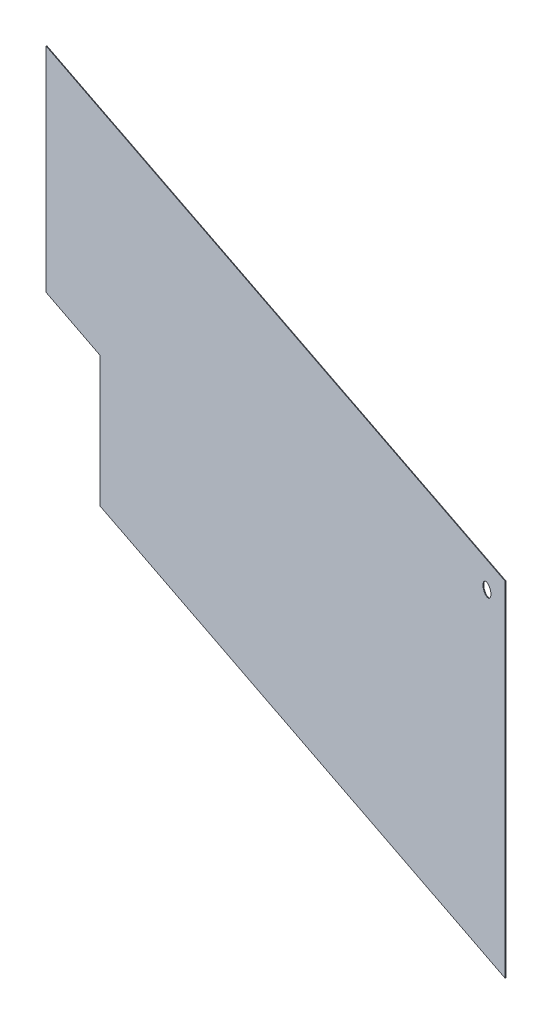
ISO-10303-21;
HEADER;
FILE_DESCRIPTION(('STEP AP214'),'2;1');
FILE_NAME('part.step','',(''),(''),'','','');
FILE_SCHEMA(('AUTOMOTIVE_DESIGN { 1 0 10303 214 1 1 1 1 }'));
ENDSEC;
DATA;
#1=APPLICATION_CONTEXT('core data for automotive mechanical design processes');
#2=APPLICATION_PROTOCOL_DEFINITION('international standard','automotive_design',2000,#1);
#3=PRODUCT_CONTEXT('',#1,'mechanical');
#4=PRODUCT('Part','Part','',(#3));
#5=PRODUCT_RELATED_PRODUCT_CATEGORY('part','',(#4));
#6=PRODUCT_DEFINITION_FORMATION('','',#4);
#7=PRODUCT_DEFINITION_CONTEXT('part definition',#1,'design');
#8=PRODUCT_DEFINITION('design','',#6,#7);
#9=PRODUCT_DEFINITION_SHAPE('','',#8);
#10=(LENGTH_UNIT() NAMED_UNIT(*) SI_UNIT(.MILLI.,.METRE.));
#11=(NAMED_UNIT(*) PLANE_ANGLE_UNIT() SI_UNIT($,.RADIAN.));
#12=(NAMED_UNIT(*) SI_UNIT($,.STERADIAN.) SOLID_ANGLE_UNIT());
#13=UNCERTAINTY_MEASURE_WITH_UNIT(LENGTH_MEASURE(1.E-05),#10,'distance_accuracy_value','');
#14=(GEOMETRIC_REPRESENTATION_CONTEXT(3) GLOBAL_UNCERTAINTY_ASSIGNED_CONTEXT((#13)) GLOBAL_UNIT_ASSIGNED_CONTEXT((#10,
#11,#12)) REPRESENTATION_CONTEXT('',''));
#15=CARTESIAN_POINT('',(0.,0.,0.));
#16=DIRECTION('',(0.,0.,1.));
#17=DIRECTION('',(1.,0.,0.));
#18=AXIS2_PLACEMENT_3D('',#15,#16,#17);
#19=CARTESIAN_POINT('',(-263.180218446603,546.5,779.785337524628));
#20=DIRECTION('',(-0.947491297113765,0.,-0.319781553398059));
#21=DIRECTION('',(0.,1.,0.));
#22=AXIS2_PLACEMENT_3D('',#19,#20,#21);
#23=PLANE('',#22);
#24=DIRECTION('',(0.319781553398059,0.,-0.947491297113765));
#25=VECTOR('',#24,1.);
#26=CARTESIAN_POINT('',(-263.180218446603,1093.,779.785337524628));
#27=LINE('',#26,#25);
#28=CARTESIAN_POINT('',(-263.500000000001,1093.,780.732828821742));
#29=VERTEX_POINT('',#28);
#30=CARTESIAN_POINT('',(-262.860436893205,1093.,778.837846227515));
#31=VERTEX_POINT('',#30);
#32=EDGE_CURVE('E11',#29,#31,#27,.T.);
#33=ORIENTED_EDGE('',*,*,#32,.F.);
#34=DIRECTION('',(0.,1.,0.));
#35=VECTOR('',#34,1.);
#36=CARTESIAN_POINT('',(-263.500000000001,546.5,780.732828821742));
#37=LINE('',#36,#35);
#38=CARTESIAN_POINT('',(-263.500000000001,0.,780.732828821742));
#39=VERTEX_POINT('',#38);
#40=EDGE_CURVE('E118',#29,#39,#37,.F.);
#41=ORIENTED_EDGE('',*,*,#40,.T.);
#42=DIRECTION('',(0.319781553398059,0.,-0.947491297113765));
#43=VECTOR('',#42,1.);
#44=CARTESIAN_POINT('',(-263.180218446603,0.,779.785337524628));
#45=LINE('',#44,#43);
#46=CARTESIAN_POINT('',(-262.860436893205,0.,778.837846227515));
#47=VERTEX_POINT('',#46);
#48=EDGE_CURVE('E51',#39,#47,#45,.T.);
#49=ORIENTED_EDGE('',*,*,#48,.T.);
#50=DIRECTION('',(0.,1.,0.));
#51=VECTOR('',#50,1.);
#52=CARTESIAN_POINT('',(-262.860436893205,546.5,778.837846227515));
#53=LINE('',#52,#51);
#54=EDGE_CURVE('E131',#31,#47,#53,.F.);
#55=ORIENTED_EDGE('',*,*,#54,.F.);
#56=EDGE_LOOP('',(#33,#41,#49,#55));
#57=FACE_BOUND('',#56,.T.);
#58=ADVANCED_FACE('F40',(#57),#23,.F.);
#59=CARTESIAN_POINT('',(-1363.52038558934,0.,408.416767716082));
#60=DIRECTION('',(0.,-1.,0.));
#61=DIRECTION('',(-0.947491297113765,0.,-0.319781553398059));
#62=AXIS2_PLACEMENT_3D('',#59,#60,#61);
#63=PLANE('',#62);
#64=ORIENTED_EDGE('',*,*,#48,.F.);
#65=DIRECTION('',(-0.947491297113765,0.,-0.319781553398059));
#66=VECTOR('',#65,1.);
#67=CARTESIAN_POINT('',(-1363.84016714274,0.,409.364259013195));
#68=LINE('',#67,#66);
#69=CARTESIAN_POINT('',(-2205.62930846116,0.,125.257544719962));
#70=VERTEX_POINT('',#69);
#71=EDGE_CURVE('E111',#39,#70,#68,.T.);
#72=ORIENTED_EDGE('',*,*,#71,.T.);
#73=DIRECTION('',(-0.606307072718308,0.,0.795230616596065));
#74=VECTOR('',#73,1.);
#75=CARTESIAN_POINT('',(-2032.58944425804,-1.11022302462516E-13,-101.701044578701));
#76=LINE('',#75,#74);
#77=CARTESIAN_POINT('',(-2204.34931535845,0.,123.578709439765));
#78=VERTEX_POINT('',#77);
#79=EDGE_CURVE('E96',#70,#78,#76,.F.);
#80=ORIENTED_EDGE('',*,*,#79,.T.);
#81=DIRECTION('',(-0.947491297113765,0.,-0.319781553398059));
#82=VECTOR('',#81,1.);
#83=CARTESIAN_POINT('',(-1363.20060403594,0.,407.469276418968));
#84=LINE('',#83,#82);
#85=EDGE_CURVE('E143',#47,#78,#84,.T.);
#86=ORIENTED_EDGE('',*,*,#85,.F.);
#87=EDGE_LOOP('',(#64,#72,#80,#86));
#88=FACE_BOUND('',#87,.T.);
#89=ADVANCED_FACE('F115',(#88),#63,.T.);
#90=CARTESIAN_POINT('',(-2204.34931535845,0.,123.578709439765));
#91=DIRECTION('',(0.795230616596064,0.,0.606307072718308));
#92=DIRECTION('',(0.606307072718308,0.,-0.795230616596065));
#93=AXIS2_PLACEMENT_3D('',#90,#91,#92);
#94=PLANE('',#93);
#95=ORIENTED_EDGE('',*,*,#79,.F.);
#96=DIRECTION('',(0.,-1.,0.));
#97=VECTOR('',#96,1.);
#98=CARTESIAN_POINT('',(-2205.62930846116,546.500000000001,125.257544719962));
#99=LINE('',#98,#97);
#100=CARTESIAN_POINT('',(-2205.62930846116,415.,125.257544719962));
#101=VERTEX_POINT('',#100);
#102=EDGE_CURVE('E44',#70,#101,#99,.F.);
#103=ORIENTED_EDGE('',*,*,#102,.T.);
#104=DIRECTION('',(-0.606307072718308,0.,0.795230616596065));
#105=VECTOR('',#104,1.);
#106=CARTESIAN_POINT('',(-2032.58944425804,415.,-101.7010445787));
#107=LINE('',#106,#105);
#108=CARTESIAN_POINT('',(-2204.34931535845,415.,123.578709439765));
#109=VERTEX_POINT('',#108);
#110=EDGE_CURVE('E90',#101,#109,#107,.F.);
#111=ORIENTED_EDGE('',*,*,#110,.T.);
#112=DIRECTION('',(0.,-1.,0.));
#113=VECTOR('',#112,1.);
#114=CARTESIAN_POINT('',(-2204.34931535845,546.500000000001,123.578709439765));
#115=LINE('',#114,#113);
#116=EDGE_CURVE('E99',#78,#109,#115,.F.);
#117=ORIENTED_EDGE('',*,*,#116,.F.);
#118=EDGE_LOOP('',(#95,#103,#111,#117));
#119=FACE_BOUND('',#118,.T.);
#120=ADVANCED_FACE('F42',(#119),#94,.F.);
#121=CARTESIAN_POINT('',(-1363.52038558934,415.,408.416767716082));
#122=DIRECTION('',(0.,-1.,0.));
#123=DIRECTION('',(-0.947491297113765,0.,-0.319781553398059));
#124=AXIS2_PLACEMENT_3D('',#121,#122,#123);
#125=PLANE('',#124);
#126=ORIENTED_EDGE('',*,*,#110,.F.);
#127=DIRECTION('',(-0.947491297113765,0.,-0.319781553398059));
#128=VECTOR('',#127,1.);
#129=CARTESIAN_POINT('',(-1363.84016714274,415.,409.364259013195));
#130=LINE('',#129,#128);
#131=CARTESIAN_POINT('',(-2464.18033428547,415.,37.9956892046474));
#132=VERTEX_POINT('',#131);
#133=EDGE_CURVE('E113',#101,#132,#130,.T.);
#134=ORIENTED_EDGE('',*,*,#133,.T.);
#135=DIRECTION('',(0.319781553398059,0.,-0.947491297113765));
#136=VECTOR('',#135,1.);
#137=CARTESIAN_POINT('',(-2463.86055273208,415.,37.0481979075337));
#138=LINE('',#137,#136);
#139=CARTESIAN_POINT('',(-2463.54077117868,415.,36.10070661042));
#140=VERTEX_POINT('',#139);
#141=EDGE_CURVE('E133',#132,#140,#138,.T.);
#142=ORIENTED_EDGE('',*,*,#141,.T.);
#143=DIRECTION('',(-0.947491297113765,0.,-0.319781553398059));
#144=VECTOR('',#143,1.);
#145=CARTESIAN_POINT('',(-1363.20060403594,415.,407.469276418968));
#146=LINE('',#145,#144);
#147=EDGE_CURVE('E142',#109,#140,#146,.T.);
#148=ORIENTED_EDGE('',*,*,#147,.F.);
#149=EDGE_LOOP('',(#126,#134,#142,#148));
#150=FACE_BOUND('',#149,.T.);
#151=ADVANCED_FACE('F151',(#150),#125,.T.);
#152=CARTESIAN_POINT('',(-2463.86055273208,546.5,37.0481979075337));
#153=DIRECTION('',(-0.947491297113765,0.,-0.319781553398059));
#154=DIRECTION('',(0.,1.,0.));
#155=AXIS2_PLACEMENT_3D('',#152,#153,#154);
#156=PLANE('',#155);
#157=ORIENTED_EDGE('',*,*,#141,.F.);
#158=DIRECTION('',(0.,1.,0.));
#159=VECTOR('',#158,1.);
#160=CARTESIAN_POINT('',(-2464.18033428547,546.5,37.9956892046474));
#161=LINE('',#160,#159);
#162=CARTESIAN_POINT('',(-2464.18033428547,1093.,37.9956892046474));
#163=VERTEX_POINT('',#162);
#164=EDGE_CURVE('E132',#132,#163,#161,.T.);
#165=ORIENTED_EDGE('',*,*,#164,.T.);
#166=DIRECTION('',(0.319781553398059,0.,-0.947491297113765));
#167=VECTOR('',#166,1.);
#168=CARTESIAN_POINT('',(-2463.86055273208,1093.,37.0481979075337));
#169=LINE('',#168,#167);
#170=CARTESIAN_POINT('',(-2463.54077117868,1093.,36.10070661042));
#171=VERTEX_POINT('',#170);
#172=EDGE_CURVE('E60',#163,#171,#169,.T.);
#173=ORIENTED_EDGE('',*,*,#172,.T.);
#174=DIRECTION('',(0.,1.,0.));
#175=VECTOR('',#174,1.);
#176=CARTESIAN_POINT('',(-2463.54077117868,546.5,36.10070661042));
#177=LINE('',#176,#175);
#178=EDGE_CURVE('E152',#140,#171,#177,.T.);
#179=ORIENTED_EDGE('',*,*,#178,.F.);
#180=EDGE_LOOP('',(#157,#165,#173,#179));
#181=FACE_BOUND('',#180,.T.);
#182=ADVANCED_FACE('F218',(#181),#156,.T.);
#183=CARTESIAN_POINT('',(-1363.52038558934,1093.,408.416767716081));
#184=DIRECTION('',(0.,-1.,0.));
#185=DIRECTION('',(-0.947491297113765,0.,-0.319781553398059));
#186=AXIS2_PLACEMENT_3D('',#183,#184,#185);
#187=PLANE('',#186);
#188=DIRECTION('',(-0.947491297113765,0.,-0.319781553398059));
#189=VECTOR('',#188,1.);
#190=CARTESIAN_POINT('',(-1363.84016714274,1093.,409.364259013195));
#191=LINE('',#190,#189);
#192=EDGE_CURVE('E127',#163,#29,#191,.F.);
#193=ORIENTED_EDGE('',*,*,#192,.T.);
#194=ORIENTED_EDGE('',*,*,#32,.T.);
#195=DIRECTION('',(-0.947491297113765,0.,-0.319781553398059));
#196=VECTOR('',#195,1.);
#197=CARTESIAN_POINT('',(-1363.20060403594,1093.,407.469276418968));
#198=LINE('',#197,#196);
#199=EDGE_CURVE('E139',#171,#31,#198,.F.);
#200=ORIENTED_EDGE('',*,*,#199,.F.);
#201=ORIENTED_EDGE('',*,*,#172,.F.);
#202=EDGE_LOOP('',(#193,#194,#200,#201));
#203=FACE_BOUND('',#202,.T.);
#204=ADVANCED_FACE('F216',(#203),#187,.F.);
#205=CARTESIAN_POINT('',(-1363.20060403594,546.5,407.469276418968));
#206=DIRECTION('',(0.319781553398059,0.,-0.947491297113765));
#207=DIRECTION('',(-0.947491297113765,0.,-0.319781553398059));
#208=AXIS2_PLACEMENT_3D('',#205,#206,#207);
#209=PLANE('',#208);
#210=CARTESIAN_POINT('',(-330.311935494597,1010.9999999752,756.072734751045));
#211=CARTESIAN_POINT('',(-330.311936914854,1010.32858473216,756.072734271703));
#212=CARTESIAN_POINT('',(-330.344453750806,1009.65710881628,756.061759728355));
#213=CARTESIAN_POINT('',(-330.47321967669,1008.32104249649,756.018300787962));
#214=CARTESIAN_POINT('',(-330.569466745073,1007.65645187487,755.985817073197));
#215=CARTESIAN_POINT('',(-330.803371922387,1006.44915122521,755.906873275848));
#216=CARTESIAN_POINT('',(-330.931609349786,1005.90438125312,755.863592705502));
#217=CARTESIAN_POINT('',(-331.230978963884,1004.82787909612,755.762554436836));
#218=CARTESIAN_POINT('',(-331.402120701275,1004.2961498431,755.704793515125));
#219=CARTESIAN_POINT('',(-331.690504221704,1003.51132225256,755.607463090647));
#220=CARTESIAN_POINT('',(-331.791991753933,1003.25166554249,755.573210701411));
#221=CARTESIAN_POINT('',(-332.005354456964,1002.73715003866,755.501200059392));
#222=CARTESIAN_POINT('',(-332.117229649767,1002.48229125506,755.463441799184));
#223=CARTESIAN_POINT('',(-332.467998668306,1001.72556949384,755.345056055722));
#224=CARTESIAN_POINT('',(-332.722080962038,1001.23143880417,755.259302412572));
#225=CARTESIAN_POINT('',(-333.268280000901,1000.26779922575,755.074958368839));
#226=CARTESIAN_POINT('',(-333.560366769904,999.798271336633,754.976378085301));
#227=CARTESIAN_POINT('',(-334.180667357163,998.886586959999,754.767024515541));
#228=CARTESIAN_POINT('',(-334.508880234727,998.444429760237,754.656251546805));
#229=CARTESIAN_POINT('',(-335.199295876775,997.590874558025,754.423233906245));
#230=CARTESIAN_POINT('',(-335.561491626211,997.179470238659,754.300991602024));
#231=CARTESIAN_POINT('',(-336.317718963862,996.39065960434,754.045762289108));
#232=CARTESIAN_POINT('',(-336.711750656816,996.013253401247,753.912775245064));
#233=CARTESIAN_POINT('',(-337.529191355135,995.293955899013,753.63688621356));
#234=CARTESIAN_POINT('',(-337.952655691174,994.952134682424,753.493965551808));
#235=CARTESIAN_POINT('',(-338.825152815771,994.307013767735,753.199494788131));
#236=CARTESIAN_POINT('',(-339.274186504647,994.003715427275,753.047944382344));
#237=CARTESIAN_POINT('',(-340.194823398484,993.437768869875,752.7372262819));
#238=CARTESIAN_POINT('',(-340.666428324887,993.175123759926,752.578058006249));
#239=CARTESIAN_POINT('',(-341.388187839003,992.813411874612,752.334461701664));
#240=CARTESIAN_POINT('',(-341.631186554462,992.698209214247,752.252448804089));
#241=CARTESIAN_POINT('',(-342.121611253601,992.478828480162,752.086928790773));
#242=CARTESIAN_POINT('',(-342.369037229893,992.37465038805,752.003421677525));
#243=CARTESIAN_POINT('',(-343.118352288048,992.078427124013,751.750525282581));
#244=CARTESIAN_POINT('',(-343.626303820428,991.903181175136,751.5790899031));
#245=CARTESIAN_POINT('',(-344.65431841771,991.59829016292,751.232131460488));
#246=CARTESIAN_POINT('',(-345.174382551565,991.468649140662,751.056608036582));
#247=CARTESIAN_POINT('',(-346.222967681262,991.255716641257,750.702706968924));
#248=CARTESIAN_POINT('',(-346.75148878671,991.172425765319,750.524329288181));
#249=CARTESIAN_POINT('',(-347.813320938359,991.052978116319,750.165957305307));
#250=CARTESIAN_POINT('',(-348.34663154752,991.016817085783,749.985963150679));
#251=CARTESIAN_POINT('',(-349.147727610479,990.998541139701,749.715590489511));
#252=CARTESIAN_POINT('',(-349.415238908462,990.998462939514,749.625304511496));
#253=CARTESIAN_POINT('',(-349.950021464134,991.010350509512,749.444813569887));
#254=CARTESIAN_POINT('',(-350.217292720598,991.022316340836,749.354608606705));
#255=CARTESIAN_POINT('',(-351.018042103613,991.076111489215,749.084352951204));
#256=CARTESIAN_POINT('',(-351.550536122554,991.13583668444,748.904634398569));
#257=CARTESIAN_POINT('',(-352.608808403197,991.302214190303,748.547463884335));
#258=CARTESIAN_POINT('',(-353.134586849952,991.408865204986,748.37001186028));
#259=CARTESIAN_POINT('',(-354.175817655346,991.66830683415,748.018592902229));
#260=CARTESIAN_POINT('',(-354.691270543258,991.821095077221,747.8446257896));
#261=CARTESIAN_POINT('',(-355.707675042455,992.171938335304,747.501585794801));
#262=CARTESIAN_POINT('',(-356.208638832379,992.369954010947,747.332508802299));
#263=CARTESIAN_POINT('',(-357.192724935431,992.810400713014,747.000376376734));
#264=CARTESIAN_POINT('',(-357.675847017681,993.05283231395,746.837321021594));
#265=CARTESIAN_POINT('',(-358.621004357371,993.579740165054,746.518327186809));
#266=CARTESIAN_POINT('',(-359.083040664444,993.864214319384,746.36238835291));
#267=CARTESIAN_POINT('',(-359.982903192987,994.473014144811,746.058681671805));
#268=CARTESIAN_POINT('',(-360.420728803852,994.797340820344,745.910914030681));
#269=CARTESIAN_POINT('',(-361.268388663728,995.483156182051,745.624825928795));
#270=CARTESIAN_POINT('',(-361.678267369724,995.844583440611,745.486490463649));
#271=CARTESIAN_POINT('',(-362.270134839253,996.41311290292,745.28673316837));
#272=CARTESIAN_POINT('',(-362.463613930761,996.607037927898,745.221433313247));
#273=CARTESIAN_POINT('',(-362.842546028141,997.00343444316,745.093542434353));
#274=CARTESIAN_POINT('',(-363.027999040195,997.205905926861,745.030951408496));
#275=CARTESIAN_POINT('',(-363.571855070587,997.82547957494,744.847398138135));
#276=CARTESIAN_POINT('',(-363.917858657167,998.254840504348,744.730620744258));
#277=CARTESIAN_POINT('',(-364.574469947678,999.142682581816,744.50901218796));
#278=CARTESIAN_POINT('',(-364.885074669637,999.601166178086,744.404182031964));
#279=CARTESIAN_POINT('',(-365.468290231676,1000.54314517272,744.207344785054));
#280=CARTESIAN_POINT('',(-365.740967382154,1001.02659483904,744.115315314154));
#281=CARTESIAN_POINT('',(-366.246871012223,1002.01599972025,743.944571108708));
#282=CARTESIAN_POINT('',(-366.480101206295,1002.52195281045,743.865855120511));
#283=CARTESIAN_POINT('',(-366.798648974087,1003.29509944378,743.75834415938));
#284=CARTESIAN_POINT('',(-366.899625020257,1003.5552149026,743.724264398439));
#285=CARTESIAN_POINT('',(-367.090993138597,1004.07974746996,743.659677003979));
#286=CARTESIAN_POINT('',(-367.181385150288,1004.34416460308,743.629169390873));
#287=CARTESIAN_POINT('',(-367.43656093377,1005.14312632134,743.543046691193));
#288=CARTESIAN_POINT('',(-367.585375815373,1005.68345748091,743.492821159674));
#289=CARTESIAN_POINT('',(-367.839362235874,1006.77444995707,743.407099874067));
#290=CARTESIAN_POINT('',(-367.944601582907,1007.32509381954,743.371581234502));
#291=CARTESIAN_POINT('',(-368.111076409654,1008.4337345434,743.315395411095));
#292=CARTESIAN_POINT('',(-368.17231437654,1008.99173098738,743.294727387824));
#293=CARTESIAN_POINT('',(-368.249980282772,1010.11122274802,743.268514878837));
#294=CARTESIAN_POINT('',(-368.266406496382,1010.67271819859,743.262970975562));
#295=CARTESIAN_POINT('',(-368.253841958607,1011.79514843021,743.267211550035));
#296=CARTESIAN_POINT('',(-368.224850418784,1012.35608320136,743.276996293883));
#297=CARTESIAN_POINT('',(-368.122342068772,1013.47315914447,743.311593212612));
#298=CARTESIAN_POINT('',(-368.048843283302,1014.0293021646,743.33639930409));
#299=CARTESIAN_POINT('',(-367.858072020486,1015.13315487918,743.400785257768));
#300=CARTESIAN_POINT('',(-367.740798508404,1015.68086437397,743.440365469196));
#301=CARTESIAN_POINT('',(-367.4631737607,1016.76409373725,743.534064771082));
#302=CARTESIAN_POINT('',(-367.302820773249,1017.29961310906,743.588184452789));
#303=CARTESIAN_POINT('',(-367.030608758296,1018.09058640085,743.680056938858));
#304=CARTESIAN_POINT('',(-366.934581652168,1018.35221454509,743.712466415609));
#305=CARTESIAN_POINT('',(-366.73204483708,1018.87091150775,743.780823283421));
#306=CARTESIAN_POINT('',(-366.625535132013,1019.12798032787,743.816770673167));
#307=CARTESIAN_POINT('',(-366.29037276805,1019.8923755525,743.929889117332));
#308=CARTESIAN_POINT('',(-366.046297913939,1020.39227816032,744.012265215382));
#309=CARTESIAN_POINT('',(-365.519317650664,1021.36870344374,744.190122856622));
#310=CARTESIAN_POINT('',(-365.236408921025,1021.84522411536,744.285605520483));
#311=CARTESIAN_POINT('',(-364.633848423613,1022.77165695787,744.488971749245));
#312=CARTESIAN_POINT('',(-364.314196039965,1023.22156868256,744.596855522005));
#313=CARTESIAN_POINT('',(-363.640219931535,1024.09151209694,744.824324763742));
#314=CARTESIAN_POINT('',(-363.28589935154,1024.51154649086,744.943909171342));
#315=CARTESIAN_POINT('',(-362.729629381144,1025.11705255872,745.131652188913));
#316=CARTESIAN_POINT('',(-362.539792106977,1025.31505619743,745.195722918228));
#317=CARTESIAN_POINT('',(-362.152301541663,1025.70235277082,745.326502309322));
#318=CARTESIAN_POINT('',(-361.954648202636,1025.89164565212,745.39321098726));
#319=CARTESIAN_POINT('',(-361.350566136034,1026.44605643638,745.597090750828));
#320=CARTESIAN_POINT('',(-360.932961017579,1026.79776555125,745.738033906605));
#321=CARTESIAN_POINT('',(-360.071390987632,1027.46296521493,746.028816738465));
#322=CARTESIAN_POINT('',(-359.627426554224,1027.77645645658,746.178656253193));
#323=CARTESIAN_POINT('',(-358.71612963644,1028.36313743499,746.486222079775));
#324=CARTESIAN_POINT('',(-358.248798454838,1028.63632941523,746.643947951938));
#325=CARTESIAN_POINT('',(-357.532688254424,1029.01421097845,746.885637593827));
#326=CARTESIAN_POINT('',(-357.291376131805,1029.13489155156,746.96708126055));
#327=CARTESIAN_POINT('',(-356.804107783401,1029.36531330131,747.131535994698));
#328=CARTESIAN_POINT('',(-356.55815158549,1029.47505454359,747.214547052715));
#329=CARTESIAN_POINT('',(-355.813978072626,1029.78751166753,747.465708158539));
#330=CARTESIAN_POINT('',(-355.309358510018,1029.97351232771,747.636018986826));
#331=CARTESIAN_POINT('',(-354.287192683887,1030.30005622189,747.98100344917));
#332=CARTESIAN_POINT('',(-353.769647036878,1030.44060161944,748.155676875152));
#333=CARTESIAN_POINT('',(-352.725222387707,1030.67552121704,748.508173766402));
#334=CARTESIAN_POINT('',(-352.198343198336,1030.76989448989,748.685997294854));
#335=CARTESIAN_POINT('',(-351.139037157363,1030.91166377105,749.043516706735));
#336=CARTESIAN_POINT('',(-350.606612120529,1030.9590746873,749.223211977673));
#337=CARTESIAN_POINT('',(-349.806697313099,1030.99439437152,749.49318596106));
#338=CARTESIAN_POINT('',(-349.539823427073,1031.00020045607,749.583256810359));
#339=CARTESIAN_POINT('',(-349.006084064532,1030.99978892837,749.763395670719));
#340=CARTESIAN_POINT('',(-348.739218588018,1030.99357131418,749.85346368178));
#341=CARTESIAN_POINT('',(-347.939398654019,1030.95702483959,750.123405645059));
#342=CARTESIAN_POINT('',(-347.407083834068,1030.90880832238,750.303063717422));
#343=CARTESIAN_POINT('',(-346.348189625776,1030.76546831599,750.660444134365));
#344=CARTESIAN_POINT('',(-345.821610708448,1030.67034100391,750.838166319975));
#345=CARTESIAN_POINT('',(-344.778056289505,1030.43399769355,751.190369505547));
#346=CARTESIAN_POINT('',(-344.261076475816,1030.29280294622,751.364851960848));
#347=CARTESIAN_POINT('',(-343.240212350491,1029.96510302615,751.709397094718));
#348=CARTESIAN_POINT('',(-342.736326836835,1029.77860202878,751.879460178973));
#349=CARTESIAN_POINT('',(-341.745431557376,1029.36096612761,752.213890724863));
#350=CARTESIAN_POINT('',(-341.258422029347,1029.12983059524,752.37825810625));
#351=CARTESIAN_POINT('',(-340.304577671316,1028.62502131357,752.700183839436));
#352=CARTESIAN_POINT('',(-339.83774454111,1028.35134398915,752.857741617549));
#353=CARTESIAN_POINT('',(-338.927659490929,1027.76388989303,753.16489843467));
#354=CARTESIAN_POINT('',(-338.484395717872,1027.45013355251,753.314501474134));
#355=CARTESIAN_POINT('',(-337.624276412182,1026.78452958717,753.604794681595));
#356=CARTESIAN_POINT('',(-337.207419271567,1026.43268428525,753.745485392293));
#357=CARTESIAN_POINT('',(-336.604430602748,1025.87812845161,753.948996130369));
#358=CARTESIAN_POINT('',(-336.407132105392,1025.68879176797,754.01558504803));
#359=CARTESIAN_POINT('',(-336.020347815739,1025.30142929274,754.146126068672));
#360=CARTESIAN_POINT('',(-335.830861981071,1025.10340354829,754.210078185955));
#361=CARTESIAN_POINT('',(-335.274668390379,1024.49681678733,754.397795425114));
#362=CARTESIAN_POINT('',(-334.920144624748,1024.07567275491,754.517448408561));
#363=CARTESIAN_POINT('',(-334.246206172645,1023.20383438314,754.744904941159));
#364=CARTESIAN_POINT('',(-333.926764015976,1022.75316361225,754.852717761595));
#365=CARTESIAN_POINT('',(-333.324705809482,1021.82519884021,755.055914465454));
#366=CARTESIAN_POINT('',(-333.042090245247,1021.34790448812,755.151298184989));
#367=CARTESIAN_POINT('',(-332.515661886658,1020.36969266521,755.32896955651));
#368=CARTESIAN_POINT('',(-332.271865405473,1019.86876537701,755.411251702746));
#369=CARTESIAN_POINT('',(-331.937084752719,1019.10249235315,755.524241318072));
#370=CARTESIAN_POINT('',(-331.830635570183,1018.84456439916,755.560168281256));
#371=CARTESIAN_POINT('',(-331.628282295374,1018.3241408478,755.628463203596));
#372=CARTESIAN_POINT('',(-331.532378269141,1018.06164522182,755.660831140462));
#373=CARTESIAN_POINT('',(-331.255572401371,1017.25330428245,755.75425406757));
#374=CARTESIAN_POINT('',(-331.091792511947,1016.70080696445,755.809530340412));
#375=CARTESIAN_POINT('',(-330.810010842772,1015.58295036819,755.904632617511));
#376=CARTESIAN_POINT('',(-330.692017097815,1015.01758885087,755.944455909998));
#377=CARTESIAN_POINT('',(-330.502727580607,1013.87892219863,756.008341769467));
#378=CARTESIAN_POINT('',(-330.431373656691,1013.30562786926,756.032423962834));
#379=CARTESIAN_POINT('',(-330.335986181952,1012.15490285112,756.064617561804));
#380=CARTESIAN_POINT('',(-330.311934273056,1011.57747385439,756.072735163319));
#381=CARTESIAN_POINT('',(-330.311935494597,1010.9999999752,756.072734751045));
#382=B_SPLINE_CURVE_WITH_KNOTS('',3,(#210,#211,#212,#213,#214,#215,#216,#217,#218,#219,#220,
#221,#222,#223,#224,#225,#226,#227,#228,#229,#230,#231,#232,#233,#234,#235,#236,#237,#238,#239,
#240,#241,#242,#243,#244,#245,#246,#247,#248,#249,#250,#251,#252,#253,#254,#255,#256,#257,#258,
#259,#260,#261,#262,#263,#264,#265,#266,#267,#268,#269,#270,#271,#272,#273,#274,#275,#276,#277,
#278,#279,#280,#281,#282,#283,#284,#285,#286,#287,#288,#289,#290,#291,#292,#293,#294,#295,#296,
#297,#298,#299,#300,#301,#302,#303,#304,#305,#306,#307,#308,#309,#310,#311,#312,#313,#314,#315,
#316,#317,#318,#319,#320,#321,#322,#323,#324,#325,#326,#327,#328,#329,#330,#331,#332,#333,#334,
#335,#336,#337,#338,#339,#340,#341,#342,#343,#344,#345,#346,#347,#348,#349,#350,#351,#352,#353,
#354,#355,#356,#357,#358,#359,#360,#361,#362,#363,#364,#365,#366,#367,#368,#369,#370,#371,#372,
#373,#374,#375,#376,#377,#378,#379,#380,#381),.UNSPECIFIED.,.T.,.F.,(4,2,2,2,2,2,2,2,2,2,2,2,2,
2,2,2,2,2,2,2,2,2,2,2,2,2,2,2,2,2,2,2,2,2,2,2,2,2,2,2,2,2,2,2,2,2,2,2,2,2,2,2,2,2,2,2,2,2,2,2,2,
2,2,2,2,2,2,2,2,2,2,2,2,2,2,2,2,2,2,2,2,2,2,2,2,4),(0.,2.01353392754214,4.02700398800872,
5.70914538511171,7.39166156748447,8.23408621753718,9.07651265200791,10.7609731667309,
12.4441130229365,14.1272090620188,15.8099584226796,17.4927133197477,19.1787219863943,
20.86479005557,22.5509869217711,23.3942214687045,24.2374546088992,25.927325705387,
27.6173465046877,29.3073892248209,30.9972792643989,31.8440641491427,32.6908533324077,
34.3841782869773,36.0774564797654,37.7706476544779,39.4623716421069,41.1541175133804,
42.8457790787993,44.5374832892812,46.2264303833867,47.0710434724432,47.9156559108659,
49.6044386550504,51.2933635559276,52.9792974886754,54.6650725787364,55.508152057336,
56.3512363533268,58.03715636585,59.7204429588871,61.4036343969405,63.0868906550926,
64.7701761343411,66.4527803654574,68.1354243720327,69.8181368137391,70.6596336374375,
71.501130148702,73.1860721910698,74.8711583935483,76.5562728445547,78.2412345786324,
79.0860777400283,79.9309260776692,81.6203765508872,83.3097963915127,84.9991221460804,
85.8443953424726,86.689663467205,88.3798562884297,90.069968648839,91.7601149476372,
93.4497245468507,94.2946730184698,95.1396216269719,96.8290865612322,98.5186891983371,
100.207513520127,101.896182261028,103.584874784741,105.273709299078,106.96168630214,
108.649560420044,109.493664806829,110.337764615151,112.025629718171,113.712163592388,
115.398719702667,117.085982704197,117.929762159722,118.77354689912,120.507891576704,
122.242540468711,123.97502241168,125.706831839746),.UNSPECIFIED.);
#383=CARTESIAN_POINT('',(-368.261438941141,1011.,743.264647542446));
#384=VERTEX_POINT('',#383);
#385=EDGE_CURVE('E122',#384,#384,#382,.F.);
#386=ORIENTED_EDGE('',*,*,#385,.T.);
#387=EDGE_LOOP('',(#386));
#388=FACE_BOUND('',#387,.T.);
#389=ORIENTED_EDGE('',*,*,#178,.T.);
#390=ORIENTED_EDGE('',*,*,#199,.T.);
#391=ORIENTED_EDGE('',*,*,#54,.T.);
#392=ORIENTED_EDGE('',*,*,#85,.T.);
#393=ORIENTED_EDGE('',*,*,#116,.T.);
#394=ORIENTED_EDGE('',*,*,#147,.T.);
#395=EDGE_LOOP('',(#389,#390,#391,#392,#393,#394));
#396=FACE_BOUND('',#395,.T.);
#397=ADVANCED_FACE('F149',(#388,#396),#209,.T.);
#398=CARTESIAN_POINT('',(-1363.84016714274,546.5,409.364259013195));
#399=DIRECTION('',(0.319781553398059,0.,-0.947491297113765));
#400=DIRECTION('',(-0.947491297113765,0.,-0.319781553398059));
#401=AXIS2_PLACEMENT_3D('',#398,#399,#400);
#402=PLANE('',#401);
#403=CARTESIAN_POINT('',(-330.997562882926,1010.99999997766,757.952170492705));
#404=CARTESIAN_POINT('',(-330.997564262868,1011.67139432431,757.95217002697));
#405=CARTESIAN_POINT('',(-331.029989456607,1012.34284813996,757.941226413182));
#406=CARTESIAN_POINT('',(-331.158420269443,1013.67890383898,757.897880574589));
#407=CARTESIAN_POINT('',(-331.254423687249,1014.34350595877,757.865479092728));
#408=CARTESIAN_POINT('',(-331.487955469115,1015.55183495103,757.786661317619));
#409=CARTESIAN_POINT('',(-331.616156519799,1016.09759610339,757.743393024538));
#410=CARTESIAN_POINT('',(-331.9155324554,1017.17608130142,757.642352622343));
#411=CARTESIAN_POINT('',(-332.08671694527,1017.70880240397,757.584577271525));
#412=CARTESIAN_POINT('',(-332.375231948354,1018.49511037444,757.487202471201));
#413=CARTESIAN_POINT('',(-332.476774831967,1018.75526016142,757.452931400683));
#414=CARTESIAN_POINT('',(-332.690268672301,1019.27075859257,757.380876499377));
#415=CARTESIAN_POINT('',(-332.802219652818,1019.52610722576,757.343092660556));
#416=CARTESIAN_POINT('',(-333.153251745422,1020.28428979309,757.224618128697));
#417=CARTESIAN_POINT('',(-333.407557031998,1020.77938286593,757.1387892247));
#418=CARTESIAN_POINT('',(-333.954278679808,1021.74482117078,756.954268798659));
#419=CARTESIAN_POINT('',(-334.246659152214,1022.21518912936,756.855589389218));
#420=CARTESIAN_POINT('',(-334.867673008478,1023.12847506936,756.64599508873));
#421=CARTESIAN_POINT('',(-335.196305373562,1023.57139382163,756.535080541521));
#422=CARTESIAN_POINT('',(-335.887703495986,1024.42634450569,756.301731310474));
#423=CARTESIAN_POINT('',(-336.2504619511,1024.83838301143,756.179299091162));
#424=CARTESIAN_POINT('',(-337.007947334499,1025.62831369079,755.923645183503));
#425=CARTESIAN_POINT('',(-337.402674417311,1026.00620569934,755.790423443004));
#426=CARTESIAN_POINT('',(-338.220740759625,1026.72552363285,755.514323254512));
#427=CARTESIAN_POINT('',(-338.644073541601,1027.06695776851,755.371446992706));
#428=CARTESIAN_POINT('',(-339.516318084154,1027.71124852514,755.077061476332));
#429=CARTESIAN_POINT('',(-339.965230638936,1028.01410394738,754.925551953717));
#430=CARTESIAN_POINT('',(-340.885641006371,1028.57906911102,754.614910306708));
#431=CARTESIAN_POINT('',(-341.35714035206,1028.84117608156,754.45577766491));
#432=CARTESIAN_POINT('',(-342.078754435383,1029.201976673,754.212230443714));
#433=CARTESIAN_POINT('',(-342.321707002997,1029.31685826044,754.130233121195));
#434=CARTESIAN_POINT('',(-342.812041527304,1029.5355593073,753.964743542193));
#435=CARTESIAN_POINT('',(-343.059423477006,1029.63937878418,753.881251288069));
#436=CARTESIAN_POINT('',(-343.807416201705,1029.93401176181,753.628801185189));
#437=CARTESIAN_POINT('',(-344.314046165156,1030.10808588858,753.457811839742));
#438=CARTESIAN_POINT('',(-345.33934011078,1030.41070666476,753.11177162637));
#439=CARTESIAN_POINT('',(-345.858005143264,1030.53924932455,752.936720403962));
#440=CARTESIAN_POINT('',(-346.903715882454,1030.75004452416,752.583789452931));
#441=CARTESIAN_POINT('',(-347.430761637527,1030.83229679673,752.405909707985));
#442=CARTESIAN_POINT('',(-348.489570694146,1030.94971155997,752.048558030024));
#443=CARTESIAN_POINT('',(-349.021333551358,1030.98487843948,751.869086246973));
#444=CARTESIAN_POINT('',(-349.819661716361,1031.00167339526,751.599647760832));
#445=CARTESIAN_POINT('',(-350.085981696135,1031.00127248526,751.509763856787));
#446=CARTESIAN_POINT('',(-350.618363194014,1030.98847703562,751.330083280394));
#447=CARTESIAN_POINT('',(-350.884424710761,1030.97608243329,751.240286608505));
#448=CARTESIAN_POINT('',(-351.681520856368,1030.92107809508,750.971263933124));
#449=CARTESIAN_POINT('',(-352.211546401693,1030.86064944055,750.792378498776));
#450=CARTESIAN_POINT('',(-353.264832610249,1030.69308403767,750.436890800925));
#451=CARTESIAN_POINT('',(-353.788093479872,1030.58594871783,750.260288467764));
#452=CARTESIAN_POINT('',(-354.824260378709,1030.3257693699,749.910578595495));
#453=CARTESIAN_POINT('',(-355.337166952774,1030.17272776419,749.737470872498));
#454=CARTESIAN_POINT('',(-356.348402244606,1029.82164161953,749.396175502865));
#455=CARTESIAN_POINT('',(-356.846745126471,1029.62364256813,749.227983075796));
#456=CARTESIAN_POINT('',(-357.825612368617,1029.18349344933,748.897612033637));
#457=CARTESIAN_POINT('',(-358.30613650036,1028.94134281588,748.735433495679));
#458=CARTESIAN_POINT('',(-359.246159154037,1028.41527913711,748.418172634985));
#459=CARTESIAN_POINT('',(-359.705658680949,1028.13136809067,748.263089973066));
#460=CARTESIAN_POINT('',(-360.600550556177,1027.52399041859,747.961060904456));
#461=CARTESIAN_POINT('',(-361.035942250817,1027.20052272115,747.814114718383));
#462=CARTESIAN_POINT('',(-361.879405888927,1026.51631125411,747.529442855695));
#463=CARTESIAN_POINT('',(-362.287488793046,1026.15558258923,747.391713479824));
#464=CARTESIAN_POINT('',(-362.876757976613,1025.58827062062,747.192833114944));
#465=CARTESIAN_POINT('',(-363.069386710954,1025.3947798491,747.127820258273));
#466=CARTESIAN_POINT('',(-363.446654246158,1024.99930790043,747.000491174806));
#467=CARTESIAN_POINT('',(-363.631293055012,1024.79732673177,746.938174945314));
#468=CARTESIAN_POINT('',(-364.172768464779,1024.17930028544,746.755425142556));
#469=CARTESIAN_POINT('',(-364.51726312898,1023.75107660392,746.639157015143));
#470=CARTESIAN_POINT('',(-365.171055813958,1022.86571683437,746.418499747853));
#471=CARTESIAN_POINT('',(-365.480350822546,1022.40857827716,746.3141116246));
#472=CARTESIAN_POINT('',(-366.061859852653,1021.46841176117,746.117850338054));
#473=CARTESIAN_POINT('',(-366.334054922282,1020.9853707448,746.025983571089));
#474=CARTESIAN_POINT('',(-366.839111224363,1019.99686714732,745.855525341736));
#475=CARTESIAN_POINT('',(-367.071976041233,1019.49140661476,745.776932669595));
#476=CARTESIAN_POINT('',(-367.390096655749,1018.71905465026,745.669565874156));
#477=CARTESIAN_POINT('',(-367.490950898694,1018.45921205524,745.635527222219));
#478=CARTESIAN_POINT('',(-367.682112369235,1017.93524029596,745.571009572098));
#479=CARTESIAN_POINT('',(-367.772419540988,1017.67111110902,745.540530592762));
#480=CARTESIAN_POINT('',(-368.027399557299,1016.87303301841,745.454473965171));
#481=CARTESIAN_POINT('',(-368.176162194721,1016.33331747478,745.404266066241));
#482=CARTESIAN_POINT('',(-368.430508951532,1015.24233718072,745.318423165897));
#483=CARTESIAN_POINT('',(-368.536061798933,1014.69106436825,745.282798718886));
#484=CARTESIAN_POINT('',(-368.703153896277,1013.58114420525,745.226404564542));
#485=CARTESIAN_POINT('',(-368.764695464801,1013.02249724477,745.20563407468));
#486=CARTESIAN_POINT('',(-368.842977860948,1011.90167864129,745.179213498238));
#487=CARTESIAN_POINT('',(-368.859716683899,1011.3395068417,745.173564088241));
#488=CARTESIAN_POINT('',(-368.847788741429,1010.21569464934,745.177589809621));
#489=CARTESIAN_POINT('',(-368.819121215409,1009.65405426562,745.187265197702));
#490=CARTESIAN_POINT('',(-368.717191236266,1008.53488395891,745.221666914285));
#491=CARTESIAN_POINT('',(-368.643895100157,1007.97735746282,745.24640461091));
#492=CARTESIAN_POINT('',(-368.453403827769,1006.87072804638,745.310696066862));
#493=CARTESIAN_POINT('',(-368.336207634341,1006.32162532922,745.35025018298));
#494=CARTESIAN_POINT('',(-368.058600364506,1005.2356151277,745.443943586025));
#495=CARTESIAN_POINT('',(-367.89818750521,1004.69870814747,745.498083474684));
#496=CARTESIAN_POINT('',(-367.625775504633,1003.90567315086,745.590023456585));
#497=CARTESIAN_POINT('',(-367.529663299177,1003.64336085647,745.622461654651));
#498=CARTESIAN_POINT('',(-367.326920293753,1003.12330393479,745.690888112406));
#499=CARTESIAN_POINT('',(-367.220289496696,1002.86555930623,745.726876371113));
#500=CARTESIAN_POINT('',(-366.884822084837,1002.09940884931,745.840097769986));
#501=CARTESIAN_POINT('',(-366.640529448334,1001.59843245908,745.922547370338));
#502=CARTESIAN_POINT('',(-366.112985992739,1000.61991075388,746.100595090912));
#503=CARTESIAN_POINT('',(-365.829731889911,1000.1423674185,746.196194319406));
#504=CARTESIAN_POINT('',(-365.226334532083,999.213977923348,746.399842991421));
#505=CARTESIAN_POINT('',(-364.906190825905,998.763132090199,746.507892587216));
#506=CARTESIAN_POINT('',(-364.231069818459,997.891450359489,746.735748236286));
#507=CARTESIAN_POINT('',(-363.87609574011,997.470611691519,746.855553201815));
#508=CARTESIAN_POINT('',(-363.319053632088,996.864395689381,747.043556818476));
#509=CARTESIAN_POINT('',(-363.129174252115,996.666403946359,747.107641758645));
#510=CARTESIAN_POINT('',(-362.741592392382,996.279141907649,747.238451961918));
#511=CARTESIAN_POINT('',(-362.543889864292,996.089871665855,747.305177241333));
#512=CARTESIAN_POINT('',(-361.939645070161,995.535551467861,747.509111925998));
#513=CARTESIAN_POINT('',(-361.521911523156,995.183933271967,747.65009842685));
#514=CARTESIAN_POINT('',(-360.660040587819,994.519014837571,747.940982815308));
#515=CARTESIAN_POINT('',(-360.215903883768,994.205713606667,748.090880471968));
#516=CARTESIAN_POINT('',(-359.304212506991,993.619554229196,748.398579429809));
#517=CARTESIAN_POINT('',(-358.83665926159,993.34669362163,748.556380249264));
#518=CARTESIAN_POINT('',(-358.120705823077,992.969724511902,748.798016983475));
#519=CARTESIAN_POINT('',(-357.879799306544,992.84953138364,748.879323756756));
#520=CARTESIAN_POINT('',(-357.393351477292,992.620090877569,749.043501562884));
#521=CARTESIAN_POINT('',(-357.14781019297,992.510843432721,749.126372586146));
#522=CARTESIAN_POINT('',(-356.404900570317,992.199864535226,749.377107124701));
#523=CARTESIAN_POINT('',(-355.90115005678,992.014845741592,749.547124645954));
#524=CARTESIAN_POINT('',(-354.880782085392,991.690269054994,749.891502326173));
#525=CARTESIAN_POINT('',(-354.36416536981,991.550708545994,750.065862234621));
#526=CARTESIAN_POINT('',(-353.321658070543,991.317776987121,750.417712013721));
#527=CARTESIAN_POINT('',(-352.795767335598,991.224406691342,750.595201935424));
#528=CARTESIAN_POINT('',(-351.73954130909,991.084815116724,750.951681831888));
#529=CARTESIAN_POINT('',(-351.209218875308,991.038486889048,751.130667467105));
#530=CARTESIAN_POINT('',(-350.412516875426,991.004692550449,751.399557116956));
#531=CARTESIAN_POINT('',(-350.146723882053,990.999378502062,751.489263161288));
#532=CARTESIAN_POINT('',(-349.615165464382,991.000737600651,751.668665945295));
#533=CARTESIAN_POINT('',(-349.349400040102,991.007410755479,751.758362684964));
#534=CARTESIAN_POINT('',(-348.55291098691,991.045259996178,752.027180464579));
#535=CARTESIAN_POINT('',(-348.022853954156,991.094259967922,752.206076526041));
#536=CARTESIAN_POINT('',(-346.968532922926,991.238986309217,752.561913480084));
#537=CARTESIAN_POINT('',(-346.444269403366,991.334716512571,752.738854211028));
#538=CARTESIAN_POINT('',(-345.405779588931,991.571981716951,753.089348075257));
#539=CARTESIAN_POINT('',(-344.891541880229,991.713460963073,753.262905060746));
#540=CARTESIAN_POINT('',(-343.876166441108,992.041457810569,753.60559774425));
#541=CARTESIAN_POINT('',(-343.375027483636,992.2279711764,753.774733856398));
#542=CARTESIAN_POINT('',(-342.389601899636,992.645351603351,754.107318361364));
#543=CARTESIAN_POINT('',(-341.905315533981,992.876219350706,754.270766666135));
#544=CARTESIAN_POINT('',(-340.956856518097,993.380194336053,754.590874827928));
#545=CARTESIAN_POINT('',(-340.492685591548,993.653305184706,754.747534103202));
#546=CARTESIAN_POINT('',(-339.587408148666,994.239582886568,755.053068336416));
#547=CARTESIAN_POINT('',(-339.146310990055,994.552765816542,755.201940136094));
#548=CARTESIAN_POINT('',(-338.290423420991,995.216968221432,755.490805117971));
#549=CARTESIAN_POINT('',(-337.875631437198,995.567985430044,755.630798831178));
#550=CARTESIAN_POINT('',(-337.275627728721,996.121103210802,755.833302134929));
#551=CARTESIAN_POINT('',(-337.079305007277,996.309928383307,755.899561724882));
#552=CARTESIAN_POINT('',(-336.694428850764,996.696201189339,756.029458744064));
#553=CARTESIAN_POINT('',(-336.505875371985,996.893648774344,756.093096188045));
#554=CARTESIAN_POINT('',(-335.952409585306,997.498406552304,756.27989278402));
#555=CARTESIAN_POINT('',(-335.599612895315,997.918204609288,756.398962873532));
#556=CARTESIAN_POINT('',(-334.928170016197,998.788056887964,756.625577141712));
#557=CARTESIAN_POINT('',(-334.609571672052,999.23815210133,756.733105172535));
#558=CARTESIAN_POINT('',(-334.009085256246,1000.16484931798,756.935771391661));
#559=CARTESIAN_POINT('',(-333.727197767937,1000.6414517423,757.030909383081));
#560=CARTESIAN_POINT('',(-333.202064847166,1001.61816879639,757.208143539907));
#561=CARTESIAN_POINT('',(-332.958836238987,1002.11829354101,757.290234027062));
#562=CARTESIAN_POINT('',(-332.624752960766,1002.88328272784,757.402988276097));
#563=CARTESIAN_POINT('',(-332.518510498926,1003.1407693852,757.43884547034));
#564=CARTESIAN_POINT('',(-332.316517683968,1003.66028725957,757.507018736247));
#565=CARTESIAN_POINT('',(-332.220767400869,1003.92231850689,757.539334784279));
#566=CARTESIAN_POINT('',(-331.943572992617,1004.73148397708,757.632888845128));
#567=CARTESIAN_POINT('',(-331.779353491224,1005.28531317745,757.688313488514));
#568=CARTESIAN_POINT('',(-331.496834855517,1006.40587677044,757.783664494339));
#569=CARTESIAN_POINT('',(-331.378543924406,1006.97261344933,757.823588088169));
#570=CARTESIAN_POINT('',(-331.188790342532,1008.11405472443,757.887630571049));
#571=CARTESIAN_POINT('',(-331.11726954935,1008.68874851718,757.911769083364));
#572=CARTESIAN_POINT('',(-331.021664442441,1009.84228126191,757.944036133936));
#573=CARTESIAN_POINT('',(-330.99756169313,1010.42111851509,757.952170894265));
#574=CARTESIAN_POINT('',(-330.997562882926,1010.99999997766,757.952170492705));
#575=B_SPLINE_CURVE_WITH_KNOTS('',3,(#403,#404,#405,#406,#407,#408,#409,#410,#411,#412,#413,
#414,#415,#416,#417,#418,#419,#420,#421,#422,#423,#424,#425,#426,#427,#428,#429,#430,#431,#432,
#433,#434,#435,#436,#437,#438,#439,#440,#441,#442,#443,#444,#445,#446,#447,#448,#449,#450,#451,
#452,#453,#454,#455,#456,#457,#458,#459,#460,#461,#462,#463,#464,#465,#466,#467,#468,#469,#470,
#471,#472,#473,#474,#475,#476,#477,#478,#479,#480,#481,#482,#483,#484,#485,#486,#487,#488,#489,
#490,#491,#492,#493,#494,#495,#496,#497,#498,#499,#500,#501,#502,#503,#504,#505,#506,#507,#508,
#509,#510,#511,#512,#513,#514,#515,#516,#517,#518,#519,#520,#521,#522,#523,#524,#525,#526,#527,
#528,#529,#530,#531,#532,#533,#534,#535,#536,#537,#538,#539,#540,#541,#542,#543,#544,#545,#546,
#547,#548,#549,#550,#551,#552,#553,#554,#555,#556,#557,#558,#559,#560,#561,#562,#563,#564,#565,
#566,#567,#568,#569,#570,#571,#572,#573,#574),.UNSPECIFIED.,.T.,.F.,(4,2,2,2,2,2,2,2,2,2,2,2,2,
2,2,2,2,2,2,2,2,2,2,2,2,2,2,2,2,2,2,2,2,2,2,2,2,2,2,2,2,2,2,2,2,2,2,2,2,2,2,2,2,2,2,2,2,2,2,2,2,
2,2,2,2,2,2,2,2,2,2,2,2,2,2,2,2,2,2,2,2,2,2,2,2,4),(0.,2.01347277704844,4.02687584459718,
5.7118721645256,7.39724534440025,8.24110388069951,9.08496434648929,10.7722924574302,
12.458041488722,14.1437431581029,15.8290849416226,17.5144348721264,19.1994044397095,
20.8844263509755,22.5695627923255,23.4122682246208,24.2549723269356,25.9397789004806,
27.6247330658262,29.3096969588654,30.9945037848083,31.8375182664086,32.6805371532244,
34.3663245469637,36.0520603847194,37.7377072851107,39.4216562027534,41.1056267108323,
42.7895166407447,44.4734522063878,46.1567078033957,46.9984737594936,47.8402388736326,
49.5233457126801,51.2065964744584,52.890703899929,54.5746577590362,55.4168350348777,
56.2590167694711,57.9431321414954,59.6284642035647,61.3137074731929,62.9990261467749,
64.6843730513252,66.3709935336074,68.0576546336586,69.7443853270477,70.5878925578991,
71.4313995551973,73.1195142304431,74.8077712700076,76.4960489599775,78.1841705775555,
79.0290829815654,79.8740006059772,81.5635909021661,83.2531374290279,84.9425810969211,
85.7860675338785,86.6295488044932,88.3161713330701,90.0026967826164,91.6892497652297,
93.3719597730431,94.2134575763069,95.0549559307695,96.7375084953358,98.4201991216469,
100.100846713235,101.781336298304,103.461851885435,105.142511191366,106.823846898008,
108.505081947195,109.345870738666,110.18665479911,111.867891792508,113.551451067223,
115.23503709124,116.919353814792,117.761660052329,118.60397191071,120.342534686022,
122.081407839622,123.818115178268,125.554147171776),.UNSPECIFIED.);
#576=CARTESIAN_POINT('',(-368.854937766324,1011.,745.175176989268));
#577=VERTEX_POINT('',#576);
#578=EDGE_CURVE('E171',#577,#577,#575,.F.);
#579=ORIENTED_EDGE('',*,*,#578,.T.);
#580=EDGE_LOOP('',(#579));
#581=FACE_BOUND('',#580,.T.);
#582=ORIENTED_EDGE('',*,*,#164,.F.);
#583=ORIENTED_EDGE('',*,*,#133,.F.);
#584=ORIENTED_EDGE('',*,*,#102,.F.);
#585=ORIENTED_EDGE('',*,*,#71,.F.);
#586=ORIENTED_EDGE('',*,*,#40,.F.);
#587=ORIENTED_EDGE('',*,*,#192,.F.);
#588=EDGE_LOOP('',(#582,#583,#584,#585,#586,#587));
#589=FACE_BOUND('',#588,.T.);
#590=ADVANCED_FACE('F109',(#581,#589),#402,.F.);
#591=CARTESIAN_POINT('',(-368.261438941141,1011.,743.264647542446));
#592=CARTESIAN_POINT('',(-368.854937766324,1011.,745.175176989268));
#593=CARTESIAN_POINT('',(-368.261438945199,1008.38068488296,743.264647541077));
#594=CARTESIAN_POINT('',(-368.854937770531,1008.38395954222,745.175176987848));
#595=CARTESIAN_POINT('',(-367.766586313763,1005.76125796844,743.431661996688));
#596=CARTESIAN_POINT('',(-368.362679715608,1005.76780742655,745.341315765012));
#597=CARTESIAN_POINT('',(-365.863696133289,1000.92287231864,744.073893940888));
#598=CARTESIAN_POINT('',(-366.468093835835,1000.93282081045,745.980744979323));
#599=CARTESIAN_POINT('',(-364.455560986848,998.70367339301,744.549144368934));
#600=CARTESIAN_POINT('',(-365.065665832003,998.713747558765,746.454069227219));
#601=CARTESIAN_POINT('',(-360.942365123367,995.003125329895,745.734859988737));
#602=CARTESIAN_POINT('',(-361.563169563911,995.010904245237,747.636173696983));
#603=CARTESIAN_POINT('',(-358.837057159974,993.52151448827,746.445408626985));
#604=CARTESIAN_POINT('',(-359.462851563907,993.526875743327,748.34503820552));
#605=CARTESIAN_POINT('',(-354.250178866025,991.520003803256,747.993495739294));
#606=CARTESIAN_POINT('',(-354.883890058542,991.521474112504,749.890453374605));
#607=CARTESIAN_POINT('',(-349.286689356093,990.480018945084,749.668690425088));
#608=CARTESIAN_POINT('',(-349.926252458448,990.478548699343,751.563673020814));
#609=CARTESIAN_POINT('',(-344.323199611497,991.52000264153,751.343885190081));
#610=CARTESIAN_POINT('',(-344.968614622183,991.521472949015,753.236892746731));
#611=CARTESIAN_POINT('',(-339.736320867289,993.521512326493,752.891972454355));
#612=CARTESIAN_POINT('',(-340.389652667916,993.526873578439,754.782308067322));
#613=CARTESIAN_POINT('',(-337.631012688816,995.003122620721,753.602521165192));
#614=CARTESIAN_POINT('',(-338.289334452702,995.010901533788,755.491172648493));
#615=CARTESIAN_POINT('',(-334.117816117319,998.703669739902,754.788237023953));
#616=CARTESIAN_POINT('',(-334.786837476825,998.713743906184,756.673277357138));
#617=CARTESIAN_POINT('',(-332.709680504451,1000.92286827635,755.26348760942));
#618=CARTESIAN_POINT('',(-333.384409007012,1000.93281677069,757.146601762304));
#619=CARTESIAN_POINT('',(-330.80678892459,1005.76125432226,755.905720025918));
#620=CARTESIAN_POINT('',(-331.489821731665,1005.76780378697,757.786031447625));
#621=CARTESIAN_POINT('',(-329.817103602879,1010.99999827185,756.23974220693));
#622=CARTESIAN_POINT('',(-330.505325459075,1010.99999827708,758.118302306812));
#623=CARTESIAN_POINT('',(-330.806788092852,1016.23874240393,755.905720306632));
#624=CARTESIAN_POINT('',(-331.489820905204,1016.23219294691,757.786031726559));
#625=CARTESIAN_POINT('',(-332.709678911116,1021.07712877678,755.263488147176));
#626=CARTESIAN_POINT('',(-333.384407421357,1021.06718028551,757.146602297468));
#627=CARTESIAN_POINT('',(-334.117814130698,1023.2963275326,754.788237694444));
#628=CARTESIAN_POINT('',(-334.78683549897,1023.2862533677,756.67327802467));
#629=CARTESIAN_POINT('',(-337.631009706544,1026.99687490552,753.602522171719));
#630=CARTESIAN_POINT('',(-338.289331479754,1026.98909599199,755.491173651873));
#631=CARTESIAN_POINT('',(-339.736317196578,1028.47848538157,752.891973693232));
#632=CARTESIAN_POINT('',(-340.389649006537,1028.47312412785,754.782309303051));
#633=CARTESIAN_POINT('',(-344.32319521371,1030.47999613696,751.34388667435));
#634=CARTESIAN_POINT('',(-344.968610233801,1030.47852582807,753.236894227826));
#635=CARTESIAN_POINT('',(-349.286685291929,1031.51998116095,749.668691796757));
#636=CARTESIAN_POINT('',(-349.926248402346,1031.52145140638,751.563674389763));
#637=CARTESIAN_POINT('',(-354.250175562266,1030.47999718102,747.993496854324));
#638=CARTESIAN_POINT('',(-354.883886763518,1030.47852687362,749.890454486687));
#639=CARTESIAN_POINT('',(-358.837054413118,1028.47848716953,746.445409554058));
#640=CARTESIAN_POINT('',(-359.462848824135,1028.47312591787,748.345039130203));
#641=CARTESIAN_POINT('',(-360.942362537213,1026.99687673998,745.734860861573));
#642=CARTESIAN_POINT('',(-361.563166985151,1026.98909782724,747.636174567324));
#643=CARTESIAN_POINT('',(-364.455558994715,1023.29632933673,744.549145041286));
#644=CARTESIAN_POINT('',(-365.065663846583,1023.28625517093,746.454069897305));
#645=CARTESIAN_POINT('',(-365.863694531164,1021.07713063274,744.073894481611));
#646=CARTESIAN_POINT('',(-366.468092239331,1021.06718213904,745.980745518149));
#647=CARTESIAN_POINT('',(-367.766585886083,1016.23874423877,743.431662141032));
#648=CARTESIAN_POINT('',(-368.362679289491,1016.23219477752,745.341315908828));
#649=CARTESIAN_POINT('',(-368.261438937083,1013.61931620868,743.264647543816));
#650=CARTESIAN_POINT('',(-368.854937762118,1013.61604154805,745.175176990687));
#651=CARTESIAN_POINT('',(-368.261438941141,1011.,743.264647542446));
#652=CARTESIAN_POINT('',(-368.854937766324,1011.,745.175176989268));
#653=B_SPLINE_SURFACE_WITH_KNOTS('',3,1,((#591,#592),(#593,#594),(#595,#596),(#597,#598),(#599,
#600),(#601,#602),(#603,#604),(#605,#606),(#607,#608),(#609,#610),(#611,#612),(#613,#614),(#615,
#616),(#617,#618),(#619,#620),(#621,#622),(#623,#624),(#625,#626),(#627,#628),(#629,#630),(#631,
#632),(#633,#634),(#635,#636),(#637,#638),(#639,#640),(#641,#642),(#643,#644),(#645,#646),(#647,
#648),(#649,#650),(#651,#652)),.UNSPECIFIED.,.T.,.F.,.F.,(4,1,1,1,1,1,1,1,1,1,1,1,1,1,1,1,1,1,1,
1,1,1,1,1,1,1,1,1,4),(2,2),(0.,0.0624984373298048,0.0625011052345802,0.124997944065562,
0.125001714821974,0.187498646209711,0.187501312180438,0.249999981547035,0.312498654665819,
0.312501320516341,0.3749982496089,0.375002020257062,0.43749885830442,0.437501526080749,
0.499999986243241,0.562498448104527,0.562501115949708,0.624997952007664,0.625001723506111,
0.687498640521915,0.68750130646799,0.749999984503298,0.812498662469546,0.812501328334876,
0.874998258010106,0.875002028660835,0.937498868846713,0.937501536623084,1.),(0.,1.),.UNSPECIFIED.);
#654=CARTESIAN_POINT('',(-368.261438941141,1011.,743.264647542446));
#655=CARTESIAN_POINT('',(-368.26762122057,1011.,743.284548890851));
#656=CARTESIAN_POINT('',(-368.273803499999,1011.,743.304450239255));
#657=CARTESIAN_POINT('',(-368.286168058857,1011.,743.344252936064));
#658=CARTESIAN_POINT('',(-368.292350338286,1011.,743.364154284469));
#659=CARTESIAN_POINT('',(-368.304714897144,1011.,743.403956981277));
#660=CARTESIAN_POINT('',(-368.310897176573,1011.,743.423858329682));
#661=CARTESIAN_POINT('',(-368.323261735431,1011.,743.463661026491));
#662=CARTESIAN_POINT('',(-368.32944401486,1011.,743.483562374895));
#663=CARTESIAN_POINT('',(-368.341808573718,1011.,743.523365071704));
#664=CARTESIAN_POINT('',(-368.347990853147,1011.,743.543266420108));
#665=CARTESIAN_POINT('',(-368.360355412005,1011.,743.583069116917));
#666=CARTESIAN_POINT('',(-368.366537691434,1011.,743.602970465321));
#667=CARTESIAN_POINT('',(-368.378902250292,1011.,743.64277316213));
#668=CARTESIAN_POINT('',(-368.385084529721,1011.,743.662674510534));
#669=CARTESIAN_POINT('',(-368.397449088579,1011.,743.702477207343));
#670=CARTESIAN_POINT('',(-368.403631368008,1011.,743.722378555747));
#671=CARTESIAN_POINT('',(-368.415995926866,1011.,743.762181252556));
#672=CARTESIAN_POINT('',(-368.422178206295,1011.,743.782082600961));
#673=CARTESIAN_POINT('',(-368.434542765153,1011.,743.821885297769));
#674=CARTESIAN_POINT('',(-368.440725044582,1011.,743.841786646174));
#675=CARTESIAN_POINT('',(-368.45308960344,1011.,743.881589342983));
#676=CARTESIAN_POINT('',(-368.459271882869,1011.,743.901490691387));
#677=CARTESIAN_POINT('',(-368.471636441727,1011.,743.941293388196));
#678=CARTESIAN_POINT('',(-368.477818721156,1011.,743.9611947366));
#679=CARTESIAN_POINT('',(-368.490183280014,1011.,744.000997433409));
#680=CARTESIAN_POINT('',(-368.496365559443,1011.,744.020898781813));
#681=CARTESIAN_POINT('',(-368.508730118301,1011.,744.060701478622));
#682=CARTESIAN_POINT('',(-368.51491239773,1011.,744.080602827026));
#683=CARTESIAN_POINT('',(-368.527276956588,1011.,744.120405523835));
#684=CARTESIAN_POINT('',(-368.533459236017,1011.,744.14030687224));
#685=CARTESIAN_POINT('',(-368.545823794875,1011.,744.180109569048));
#686=CARTESIAN_POINT('',(-368.552006074304,1011.,744.200010917453));
#687=CARTESIAN_POINT('',(-368.564370633162,1011.,744.239813614261));
#688=CARTESIAN_POINT('',(-368.570552912591,1011.,744.259714962666));
#689=CARTESIAN_POINT('',(-368.582917471449,1011.,744.299517659475));
#690=CARTESIAN_POINT('',(-368.589099750878,1011.,744.319419007879));
#691=CARTESIAN_POINT('',(-368.601464309736,1011.,744.359221704688));
#692=CARTESIAN_POINT('',(-368.607646589165,1011.,744.379123053092));
#693=CARTESIAN_POINT('',(-368.620011148023,1011.,744.418925749901));
#694=CARTESIAN_POINT('',(-368.626193427452,1011.,744.438827098305));
#695=CARTESIAN_POINT('',(-368.63855798631,1011.,744.478629795114));
#696=CARTESIAN_POINT('',(-368.644740265739,1011.,744.498531143518));
#697=CARTESIAN_POINT('',(-368.657104824597,1011.,744.538333840327));
#698=CARTESIAN_POINT('',(-368.663287104026,1011.,744.558235188732));
#699=CARTESIAN_POINT('',(-368.675651662884,1011.,744.598037885541));
#700=CARTESIAN_POINT('',(-368.681833942313,1011.,744.617939233945));
#701=CARTESIAN_POINT('',(-368.694198501171,1011.,744.657741930754));
#702=CARTESIAN_POINT('',(-368.7003807806,1011.,744.677643279158));
#703=CARTESIAN_POINT('',(-368.712745339458,1011.,744.717445975967));
#704=CARTESIAN_POINT('',(-368.718927618887,1011.,744.737347324371));
#705=CARTESIAN_POINT('',(-368.731292177745,1011.,744.77715002118));
#706=CARTESIAN_POINT('',(-368.737474457174,1011.,744.797051369584));
#707=CARTESIAN_POINT('',(-368.749839016032,1011.,744.836854066393));
#708=CARTESIAN_POINT('',(-368.756021295461,1011.,744.856755414797));
#709=CARTESIAN_POINT('',(-368.768385854319,1011.,744.896558111606));
#710=CARTESIAN_POINT('',(-368.774568133748,1011.,744.916459460011));
#711=CARTESIAN_POINT('',(-368.786932692606,1011.,744.956262156819));
#712=CARTESIAN_POINT('',(-368.793114972035,1011.,744.976163505224));
#713=CARTESIAN_POINT('',(-368.805479530893,1011.,745.015966202032));
#714=CARTESIAN_POINT('',(-368.811661810321,1011.,745.035867550437));
#715=CARTESIAN_POINT('',(-368.824026369179,1011.,745.075670247246));
#716=CARTESIAN_POINT('',(-368.830208648609,1011.,745.09557159565));
#717=CARTESIAN_POINT('',(-368.842573207467,1011.,745.135374292459));
#718=CARTESIAN_POINT('',(-368.848755486895,1011.,745.155275640863));
#719=CARTESIAN_POINT('',(-368.854937766324,1011.,745.175176989268));
#720=B_SPLINE_CURVE_WITH_KNOTS('',3,(#654,#655,#656,#657,#658,#659,#660,#661,#662,#663,#664,
#665,#666,#667,#668,#669,#670,#671,#672,#673,#674,#675,#676,#677,#678,#679,#680,#681,#682,#683,
#684,#685,#686,#687,#688,#689,#690,#691,#692,#693,#694,#695,#696,#697,#698,#699,#700,#701,#702,
#703,#704,#705,#706,#707,#708,#709,#710,#711,#712,#713,#714,#715,#716,#717,#718,#719),
.UNSPECIFIED.,.F.,.F.,(4,2,2,2,2,2,2,2,2,2,2,2,2,2,2,2,2,2,2,2,2,2,2,2,2,2,2,2,2,2,2,2,4),(0.,
0.0625184630750833,0.125036926150167,0.187555389225071,0.250073852300154,0.312592315375058,
0.375110778450035,0.437629241525013,0.500147704599884,0.562666167674984,0.625184630749977,
0.687703093824971,0.750221556899948,0.812740019974942,0.875258483049919,0.937776946124929,
1.00029540919991,1.06281387227488,1.12533233534988,1.18785079842485,1.25036926149974,
1.31288772457484,1.37540618764984,1.43792465072483,1.5004431137997,1.5629615768748,
1.62548003994967,1.68799850302477,1.75051696609966,1.81303542917464,1.87555389224961,
1.93807235532461,2.00059081839971),.UNSPECIFIED.);
#721=EDGE_CURVE('',#384,#577,#720,.T.);
#722=ORIENTED_EDGE('',*,*,#385,.F.);
#723=ORIENTED_EDGE('',*,*,#578,.F.);
#724=ORIENTED_EDGE('',*,*,#721,.T.);
#725=ORIENTED_EDGE('',*,*,#721,.F.);
#726=EDGE_LOOP('',(#722,#724,#723,#725));
#727=FACE_BOUND('',#726,.T.);
#728=ADVANCED_FACE('F190',(#727),#653,.F.);
#729=CLOSED_SHELL('',(#58,#89,#120,#151,#182,#204,#397,#590,#728));
#730=MANIFOLD_SOLID_BREP('B2',#729);
#731=ADVANCED_BREP_SHAPE_REPRESENTATION('',(#18,#730),#14);
#732=SHAPE_DEFINITION_REPRESENTATION(#9,#731);
ENDSEC;
END-ISO-10303-21;
